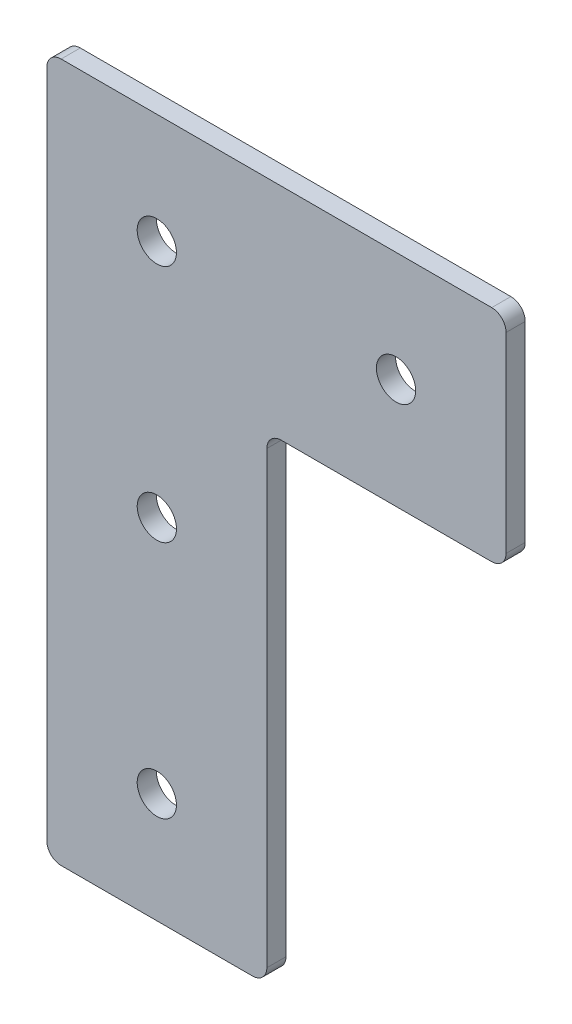
ISO-10303-21;
HEADER;
FILE_DESCRIPTION(('STEP AP214'),'2;1');
FILE_NAME('part.step','',(''),(''),'','','');
FILE_SCHEMA(('AUTOMOTIVE_DESIGN { 1 0 10303 214 1 1 1 1 }'));
ENDSEC;
DATA;
#1=APPLICATION_CONTEXT('core data for automotive mechanical design processes');
#2=APPLICATION_PROTOCOL_DEFINITION('international standard','automotive_design',2000,#1);
#3=PRODUCT_CONTEXT('',#1,'mechanical');
#4=PRODUCT('Part','Part','',(#3));
#5=PRODUCT_RELATED_PRODUCT_CATEGORY('part','',(#4));
#6=PRODUCT_DEFINITION_FORMATION('','',#4);
#7=PRODUCT_DEFINITION_CONTEXT('part definition',#1,'design');
#8=PRODUCT_DEFINITION('design','',#6,#7);
#9=PRODUCT_DEFINITION_SHAPE('','',#8);
#10=(LENGTH_UNIT() NAMED_UNIT(*) SI_UNIT(.MILLI.,.METRE.));
#11=(NAMED_UNIT(*) PLANE_ANGLE_UNIT() SI_UNIT($,.RADIAN.));
#12=(NAMED_UNIT(*) SI_UNIT($,.STERADIAN.) SOLID_ANGLE_UNIT());
#13=UNCERTAINTY_MEASURE_WITH_UNIT(LENGTH_MEASURE(1.E-05),#10,'distance_accuracy_value','');
#14=(GEOMETRIC_REPRESENTATION_CONTEXT(3) GLOBAL_UNCERTAINTY_ASSIGNED_CONTEXT((#13)) GLOBAL_UNIT_ASSIGNED_CONTEXT((#10,
#11,#12)) REPRESENTATION_CONTEXT('',''));
#15=CARTESIAN_POINT('',(0.,0.,0.));
#16=DIRECTION('',(0.,0.,1.));
#17=DIRECTION('',(1.,0.,0.));
#18=AXIS2_PLACEMENT_3D('',#15,#16,#17);
#19=CARTESIAN_POINT('',(0.,0.,4.));
#20=DIRECTION('',(0.,0.,1.));
#21=DIRECTION('',(1.,0.,0.));
#22=AXIS2_PLACEMENT_3D('',#19,#20,#21);
#23=PLANE('',#22);
#24=CARTESIAN_POINT('',(5.20660583828602E-13,-50.,4.));
#25=DIRECTION('',(0.,0.,1.));
#26=DIRECTION('',(1.,0.,0.));
#27=AXIS2_PLACEMENT_3D('',#24,#25,#26);
#28=CIRCLE('',#27,4.1);
#29=CARTESIAN_POINT('',(4.10000000000052,-50.,4.));
#30=VERTEX_POINT('',#29);
#31=EDGE_CURVE('E225',#30,#30,#28,.T.);
#32=ORIENTED_EDGE('',*,*,#31,.F.);
#33=EDGE_LOOP('',(#32));
#34=FACE_BOUND('',#33,.T.);
#35=CARTESIAN_POINT('',(0.,0.,4.));
#36=DIRECTION('',(0.,0.,1.));
#37=DIRECTION('',(1.,0.,0.));
#38=AXIS2_PLACEMENT_3D('',#35,#36,#37);
#39=CIRCLE('',#38,4.1);
#40=CARTESIAN_POINT('',(4.1,0.,4.));
#41=VERTEX_POINT('',#40);
#42=EDGE_CURVE('E133',#41,#41,#39,.T.);
#43=ORIENTED_EDGE('',*,*,#42,.F.);
#44=EDGE_LOOP('',(#43));
#45=FACE_BOUND('',#44,.T.);
#46=DIRECTION('',(-1.,0.,0.));
#47=VECTOR('',#46,1.);
#48=CARTESIAN_POINT('',(-23.,23.,4.));
#49=LINE('',#48,#47);
#50=CARTESIAN_POINT('',(70.,23.,4.));
#51=VERTEX_POINT('',#50);
#52=CARTESIAN_POINT('',(-20.,23.,4.));
#53=VERTEX_POINT('',#52);
#54=EDGE_CURVE('E142',#51,#53,#49,.T.);
#55=ORIENTED_EDGE('',*,*,#54,.T.);
#56=CARTESIAN_POINT('',(-20.,20.,4.));
#57=DIRECTION('',(0.,0.,1.));
#58=DIRECTION('',(1.,0.,0.));
#59=AXIS2_PLACEMENT_3D('',#56,#57,#58);
#60=CIRCLE('',#59,3.);
#61=CARTESIAN_POINT('',(-23.,20.,4.));
#62=VERTEX_POINT('',#61);
#63=EDGE_CURVE('E171',#53,#62,#60,.T.);
#64=ORIENTED_EDGE('',*,*,#63,.T.);
#65=DIRECTION('',(0.,-1.,0.));
#66=VECTOR('',#65,1.);
#67=CARTESIAN_POINT('',(-23.,23.,4.));
#68=LINE('',#67,#66);
#69=CARTESIAN_POINT('',(-23.,-120.,4.));
#70=VERTEX_POINT('',#69);
#71=EDGE_CURVE('E125',#62,#70,#68,.T.);
#72=ORIENTED_EDGE('',*,*,#71,.T.);
#73=CARTESIAN_POINT('',(-20.,-120.,4.));
#74=DIRECTION('',(0.,0.,1.));
#75=DIRECTION('',(1.,0.,0.));
#76=AXIS2_PLACEMENT_3D('',#73,#74,#75);
#77=CIRCLE('',#76,3.);
#78=CARTESIAN_POINT('',(-20.,-123.,4.));
#79=VERTEX_POINT('',#78);
#80=EDGE_CURVE('E169',#70,#79,#77,.T.);
#81=ORIENTED_EDGE('',*,*,#80,.T.);
#82=DIRECTION('',(1.,0.,0.));
#83=VECTOR('',#82,1.);
#84=CARTESIAN_POINT('',(-23.,-123.,4.));
#85=LINE('',#84,#83);
#86=CARTESIAN_POINT('',(20.,-123.,4.));
#87=VERTEX_POINT('',#86);
#88=EDGE_CURVE('E213',#79,#87,#85,.T.);
#89=ORIENTED_EDGE('',*,*,#88,.T.);
#90=CARTESIAN_POINT('',(20.,-120.,4.));
#91=DIRECTION('',(0.,0.,1.));
#92=DIRECTION('',(1.,0.,0.));
#93=AXIS2_PLACEMENT_3D('',#90,#91,#92);
#94=CIRCLE('',#93,3.);
#95=CARTESIAN_POINT('',(23.,-120.,4.));
#96=VERTEX_POINT('',#95);
#97=EDGE_CURVE('E167',#87,#96,#94,.T.);
#98=ORIENTED_EDGE('',*,*,#97,.T.);
#99=DIRECTION('',(0.,1.,0.));
#100=VECTOR('',#99,1.);
#101=CARTESIAN_POINT('',(23.,-23.,4.));
#102=LINE('',#101,#100);
#103=CARTESIAN_POINT('',(23.,-26.,4.));
#104=VERTEX_POINT('',#103);
#105=EDGE_CURVE('E207',#96,#104,#102,.T.);
#106=ORIENTED_EDGE('',*,*,#105,.T.);
#107=CARTESIAN_POINT('',(26.,-26.,4.));
#108=DIRECTION('',(0.,0.,1.));
#109=DIRECTION('',(1.,0.,0.));
#110=AXIS2_PLACEMENT_3D('',#107,#108,#109);
#111=CIRCLE('',#110,3.);
#112=CARTESIAN_POINT('',(26.,-23.,4.));
#113=VERTEX_POINT('',#112);
#114=EDGE_CURVE('E9',#104,#113,#111,.F.);
#115=ORIENTED_EDGE('',*,*,#114,.T.);
#116=DIRECTION('',(1.,0.,0.));
#117=VECTOR('',#116,1.);
#118=CARTESIAN_POINT('',(23.,-23.,4.));
#119=LINE('',#118,#117);
#120=CARTESIAN_POINT('',(70.,-23.,4.));
#121=VERTEX_POINT('',#120);
#122=EDGE_CURVE('E206',#113,#121,#119,.T.);
#123=ORIENTED_EDGE('',*,*,#122,.T.);
#124=CARTESIAN_POINT('',(70.,-20.,4.));
#125=DIRECTION('',(0.,0.,1.));
#126=DIRECTION('',(1.,0.,0.));
#127=AXIS2_PLACEMENT_3D('',#124,#125,#126);
#128=CIRCLE('',#127,3.);
#129=CARTESIAN_POINT('',(73.,-20.,4.));
#130=VERTEX_POINT('',#129);
#131=EDGE_CURVE('E37',#121,#130,#128,.T.);
#132=ORIENTED_EDGE('',*,*,#131,.T.);
#133=DIRECTION('',(0.,1.,0.));
#134=VECTOR('',#133,1.);
#135=CARTESIAN_POINT('',(73.,23.,4.));
#136=LINE('',#135,#134);
#137=CARTESIAN_POINT('',(73.,20.,4.));
#138=VERTEX_POINT('',#137);
#139=EDGE_CURVE('E211',#130,#138,#136,.T.);
#140=ORIENTED_EDGE('',*,*,#139,.T.);
#141=CARTESIAN_POINT('',(70.,20.,4.));
#142=DIRECTION('',(0.,0.,1.));
#143=DIRECTION('',(1.,0.,0.));
#144=AXIS2_PLACEMENT_3D('',#141,#142,#143);
#145=CIRCLE('',#144,3.);
#146=EDGE_CURVE('E165',#138,#51,#145,.T.);
#147=ORIENTED_EDGE('',*,*,#146,.T.);
#148=EDGE_LOOP('',(#55,#64,#72,#81,#89,#98,#106,#115,#123,#132,#140,#147));
#149=FACE_BOUND('',#148,.T.);
#150=CARTESIAN_POINT('',(50.,0.,4.));
#151=DIRECTION('',(0.,0.,1.));
#152=DIRECTION('',(1.,0.,0.));
#153=AXIS2_PLACEMENT_3D('',#150,#151,#152);
#154=CIRCLE('',#153,4.09999999999999);
#155=CARTESIAN_POINT('',(54.1,0.,4.));
#156=VERTEX_POINT('',#155);
#157=EDGE_CURVE('E220',#156,#156,#154,.T.);
#158=ORIENTED_EDGE('',*,*,#157,.F.);
#159=EDGE_LOOP('',(#158));
#160=FACE_BOUND('',#159,.T.);
#161=CARTESIAN_POINT('',(1.0413211676572E-12,-100.,4.));
#162=DIRECTION('',(0.,0.,1.));
#163=DIRECTION('',(1.,0.,0.));
#164=AXIS2_PLACEMENT_3D('',#161,#162,#163);
#165=CIRCLE('',#164,4.1);
#166=CARTESIAN_POINT('',(4.10000000000105,-100.,4.));
#167=VERTEX_POINT('',#166);
#168=EDGE_CURVE('E231',#167,#167,#165,.T.);
#169=ORIENTED_EDGE('',*,*,#168,.F.);
#170=EDGE_LOOP('',(#169));
#171=FACE_BOUND('',#170,.T.);
#172=ADVANCED_FACE('F15',(#34,#45,#149,#160,#171),#23,.T.);
#173=CARTESIAN_POINT('',(0.,0.,0.));
#174=DIRECTION('',(0.,0.,1.));
#175=DIRECTION('',(1.,0.,0.));
#176=AXIS2_PLACEMENT_3D('',#173,#174,#175);
#177=PLANE('',#176);
#178=DIRECTION('',(0.,-1.,0.));
#179=VECTOR('',#178,1.);
#180=CARTESIAN_POINT('',(-23.,-23.,0.));
#181=LINE('',#180,#179);
#182=CARTESIAN_POINT('',(-23.,20.,0.));
#183=VERTEX_POINT('',#182);
#184=CARTESIAN_POINT('',(-23.,-120.,0.));
#185=VERTEX_POINT('',#184);
#186=EDGE_CURVE('E122',#183,#185,#181,.T.);
#187=ORIENTED_EDGE('',*,*,#186,.F.);
#188=CARTESIAN_POINT('',(-20.,20.,0.));
#189=DIRECTION('',(0.,0.,1.));
#190=DIRECTION('',(1.,0.,0.));
#191=AXIS2_PLACEMENT_3D('',#188,#189,#190);
#192=CIRCLE('',#191,3.);
#193=CARTESIAN_POINT('',(-20.,23.,0.));
#194=VERTEX_POINT('',#193);
#195=EDGE_CURVE('E105',#183,#194,#192,.F.);
#196=ORIENTED_EDGE('',*,*,#195,.T.);
#197=DIRECTION('',(-1.,0.,0.));
#198=VECTOR('',#197,1.);
#199=CARTESIAN_POINT('',(-23.,23.,0.));
#200=LINE('',#199,#198);
#201=CARTESIAN_POINT('',(70.,23.,0.));
#202=VERTEX_POINT('',#201);
#203=EDGE_CURVE('E152',#202,#194,#200,.T.);
#204=ORIENTED_EDGE('',*,*,#203,.F.);
#205=CARTESIAN_POINT('',(70.,20.,0.));
#206=DIRECTION('',(0.,0.,1.));
#207=DIRECTION('',(1.,0.,0.));
#208=AXIS2_PLACEMENT_3D('',#205,#206,#207);
#209=CIRCLE('',#208,3.);
#210=CARTESIAN_POINT('',(73.,20.,0.));
#211=VERTEX_POINT('',#210);
#212=EDGE_CURVE('E156',#202,#211,#209,.F.);
#213=ORIENTED_EDGE('',*,*,#212,.T.);
#214=DIRECTION('',(0.,1.,0.));
#215=VECTOR('',#214,1.);
#216=CARTESIAN_POINT('',(73.,23.,0.));
#217=LINE('',#216,#215);
#218=CARTESIAN_POINT('',(73.,-20.,0.));
#219=VERTEX_POINT('',#218);
#220=EDGE_CURVE('E150',#219,#211,#217,.T.);
#221=ORIENTED_EDGE('',*,*,#220,.F.);
#222=CARTESIAN_POINT('',(70.,-20.,0.));
#223=DIRECTION('',(0.,0.,1.));
#224=DIRECTION('',(1.,0.,0.));
#225=AXIS2_PLACEMENT_3D('',#222,#223,#224);
#226=CIRCLE('',#225,3.);
#227=CARTESIAN_POINT('',(70.,-23.,0.));
#228=VERTEX_POINT('',#227);
#229=EDGE_CURVE('E126',#219,#228,#226,.F.);
#230=ORIENTED_EDGE('',*,*,#229,.T.);
#231=DIRECTION('',(1.,0.,0.));
#232=VECTOR('',#231,1.);
#233=CARTESIAN_POINT('',(23.,-23.,0.));
#234=LINE('',#233,#232);
#235=CARTESIAN_POINT('',(26.,-23.,0.));
#236=VERTEX_POINT('',#235);
#237=EDGE_CURVE('E147',#236,#228,#234,.T.);
#238=ORIENTED_EDGE('',*,*,#237,.F.);
#239=CARTESIAN_POINT('',(26.,-26.,0.));
#240=DIRECTION('',(0.,0.,1.));
#241=DIRECTION('',(1.,0.,0.));
#242=AXIS2_PLACEMENT_3D('',#239,#240,#241);
#243=CIRCLE('',#242,3.);
#244=CARTESIAN_POINT('',(23.,-26.,0.));
#245=VERTEX_POINT('',#244);
#246=EDGE_CURVE('E23',#236,#245,#243,.T.);
#247=ORIENTED_EDGE('',*,*,#246,.T.);
#248=DIRECTION('',(0.,1.,0.));
#249=VECTOR('',#248,1.);
#250=CARTESIAN_POINT('',(23.,-23.,0.));
#251=LINE('',#250,#249);
#252=CARTESIAN_POINT('',(23.,-120.,0.));
#253=VERTEX_POINT('',#252);
#254=EDGE_CURVE('E136',#253,#245,#251,.T.);
#255=ORIENTED_EDGE('',*,*,#254,.F.);
#256=CARTESIAN_POINT('',(20.,-120.,0.));
#257=DIRECTION('',(0.,0.,1.));
#258=DIRECTION('',(1.,0.,0.));
#259=AXIS2_PLACEMENT_3D('',#256,#257,#258);
#260=CIRCLE('',#259,3.);
#261=CARTESIAN_POINT('',(20.,-123.,0.));
#262=VERTEX_POINT('',#261);
#263=EDGE_CURVE('E158',#253,#262,#260,.F.);
#264=ORIENTED_EDGE('',*,*,#263,.T.);
#265=DIRECTION('',(1.,0.,0.));
#266=VECTOR('',#265,1.);
#267=CARTESIAN_POINT('',(-23.,-123.,0.));
#268=LINE('',#267,#266);
#269=CARTESIAN_POINT('',(-20.,-123.,0.));
#270=VERTEX_POINT('',#269);
#271=EDGE_CURVE('E132',#270,#262,#268,.T.);
#272=ORIENTED_EDGE('',*,*,#271,.F.);
#273=CARTESIAN_POINT('',(-20.,-120.,0.));
#274=DIRECTION('',(0.,0.,1.));
#275=DIRECTION('',(1.,0.,0.));
#276=AXIS2_PLACEMENT_3D('',#273,#274,#275);
#277=CIRCLE('',#276,3.);
#278=EDGE_CURVE('E116',#270,#185,#277,.F.);
#279=ORIENTED_EDGE('',*,*,#278,.T.);
#280=EDGE_LOOP('',(#187,#196,#204,#213,#221,#230,#238,#247,#255,#264,#272,#279));
#281=FACE_BOUND('',#280,.T.);
#282=CARTESIAN_POINT('',(0.,0.,0.));
#283=DIRECTION('',(0.,0.,1.));
#284=DIRECTION('',(1.,0.,0.));
#285=AXIS2_PLACEMENT_3D('',#282,#283,#284);
#286=CIRCLE('',#285,4.1);
#287=CARTESIAN_POINT('',(4.1,0.,0.));
#288=VERTEX_POINT('',#287);
#289=EDGE_CURVE('E139',#288,#288,#286,.T.);
#290=ORIENTED_EDGE('',*,*,#289,.T.);
#291=EDGE_LOOP('',(#290));
#292=FACE_BOUND('',#291,.T.);
#293=CARTESIAN_POINT('',(50.,0.,0.));
#294=DIRECTION('',(0.,0.,1.));
#295=DIRECTION('',(1.,0.,0.));
#296=AXIS2_PLACEMENT_3D('',#293,#294,#295);
#297=CIRCLE('',#296,4.09999999999999);
#298=CARTESIAN_POINT('',(54.1,0.,0.));
#299=VERTEX_POINT('',#298);
#300=EDGE_CURVE('E222',#299,#299,#297,.T.);
#301=ORIENTED_EDGE('',*,*,#300,.T.);
#302=EDGE_LOOP('',(#301));
#303=FACE_BOUND('',#302,.T.);
#304=CARTESIAN_POINT('',(5.20660583828602E-13,-50.,0.));
#305=DIRECTION('',(0.,0.,1.));
#306=DIRECTION('',(1.,0.,0.));
#307=AXIS2_PLACEMENT_3D('',#304,#305,#306);
#308=CIRCLE('',#307,4.1);
#309=CARTESIAN_POINT('',(4.10000000000052,-50.,0.));
#310=VERTEX_POINT('',#309);
#311=EDGE_CURVE('E228',#310,#310,#308,.T.);
#312=ORIENTED_EDGE('',*,*,#311,.T.);
#313=EDGE_LOOP('',(#312));
#314=FACE_BOUND('',#313,.T.);
#315=CARTESIAN_POINT('',(1.0413211676572E-12,-100.,0.));
#316=DIRECTION('',(0.,0.,1.));
#317=DIRECTION('',(1.,0.,0.));
#318=AXIS2_PLACEMENT_3D('',#315,#316,#317);
#319=CIRCLE('',#318,4.1);
#320=CARTESIAN_POINT('',(4.10000000000105,-100.,0.));
#321=VERTEX_POINT('',#320);
#322=EDGE_CURVE('E234',#321,#321,#319,.T.);
#323=ORIENTED_EDGE('',*,*,#322,.T.);
#324=EDGE_LOOP('',(#323));
#325=FACE_BOUND('',#324,.T.);
#326=ADVANCED_FACE('F129',(#281,#292,#303,#314,#325),#177,.F.);
#327=CARTESIAN_POINT('',(-23.,-23.,4.));
#328=DIRECTION('',(1.,0.,0.));
#329=DIRECTION('',(0.,1.,0.));
#330=AXIS2_PLACEMENT_3D('',#327,#328,#329);
#331=PLANE('',#330);
#332=ORIENTED_EDGE('',*,*,#71,.F.);
#333=DIRECTION('',(0.,0.,-1.));
#334=VECTOR('',#333,1.);
#335=CARTESIAN_POINT('',(-23.,20.,4.));
#336=LINE('',#335,#334);
#337=EDGE_CURVE('E109',#62,#183,#336,.T.);
#338=ORIENTED_EDGE('',*,*,#337,.T.);
#339=ORIENTED_EDGE('',*,*,#186,.T.);
#340=DIRECTION('',(0.,0.,-1.));
#341=VECTOR('',#340,1.);
#342=CARTESIAN_POINT('',(-23.,-120.,4.));
#343=LINE('',#342,#341);
#344=EDGE_CURVE('E127',#185,#70,#343,.F.);
#345=ORIENTED_EDGE('',*,*,#344,.T.);
#346=EDGE_LOOP('',(#332,#338,#339,#345));
#347=FACE_BOUND('',#346,.T.);
#348=ADVANCED_FACE('F121',(#347),#331,.F.);
#349=CARTESIAN_POINT('',(-23.,-123.,4.));
#350=DIRECTION('',(0.,1.,0.));
#351=DIRECTION('',(0.,0.,1.));
#352=AXIS2_PLACEMENT_3D('',#349,#350,#351);
#353=PLANE('',#352);
#354=ORIENTED_EDGE('',*,*,#88,.F.);
#355=DIRECTION('',(0.,0.,-1.));
#356=VECTOR('',#355,1.);
#357=CARTESIAN_POINT('',(-20.,-123.,4.));
#358=LINE('',#357,#356);
#359=EDGE_CURVE('E175',#79,#270,#358,.T.);
#360=ORIENTED_EDGE('',*,*,#359,.T.);
#361=ORIENTED_EDGE('',*,*,#271,.T.);
#362=DIRECTION('',(0.,0.,-1.));
#363=VECTOR('',#362,1.);
#364=CARTESIAN_POINT('',(20.,-123.,4.));
#365=LINE('',#364,#363);
#366=EDGE_CURVE('E173',#262,#87,#365,.F.);
#367=ORIENTED_EDGE('',*,*,#366,.T.);
#368=EDGE_LOOP('',(#354,#360,#361,#367));
#369=FACE_BOUND('',#368,.T.);
#370=ADVANCED_FACE('F268',(#369),#353,.F.);
#371=CARTESIAN_POINT('',(23.,-23.,4.));
#372=DIRECTION('',(-1.,0.,0.));
#373=DIRECTION('',(0.,-1.,0.));
#374=AXIS2_PLACEMENT_3D('',#371,#372,#373);
#375=PLANE('',#374);
#376=ORIENTED_EDGE('',*,*,#105,.F.);
#377=DIRECTION('',(0.,0.,-1.));
#378=VECTOR('',#377,1.);
#379=CARTESIAN_POINT('',(23.,-120.,4.));
#380=LINE('',#379,#378);
#381=EDGE_CURVE('E180',#96,#253,#380,.T.);
#382=ORIENTED_EDGE('',*,*,#381,.T.);
#383=ORIENTED_EDGE('',*,*,#254,.T.);
#384=DIRECTION('',(0.,0.,-1.));
#385=VECTOR('',#384,1.);
#386=CARTESIAN_POINT('',(23.,-26.,4.));
#387=LINE('',#386,#385);
#388=EDGE_CURVE('E178',#245,#104,#387,.F.);
#389=ORIENTED_EDGE('',*,*,#388,.T.);
#390=EDGE_LOOP('',(#376,#382,#383,#389));
#391=FACE_BOUND('',#390,.T.);
#392=ADVANCED_FACE('F198',(#391),#375,.F.);
#393=CARTESIAN_POINT('',(23.,-23.,4.));
#394=DIRECTION('',(0.,1.,0.));
#395=DIRECTION('',(-1.,0.,0.));
#396=AXIS2_PLACEMENT_3D('',#393,#394,#395);
#397=PLANE('',#396);
#398=ORIENTED_EDGE('',*,*,#122,.F.);
#399=DIRECTION('',(0.,0.,-1.));
#400=VECTOR('',#399,1.);
#401=CARTESIAN_POINT('',(26.,-23.,0.));
#402=LINE('',#401,#400);
#403=EDGE_CURVE('E185',#113,#236,#402,.T.);
#404=ORIENTED_EDGE('',*,*,#403,.T.);
#405=ORIENTED_EDGE('',*,*,#237,.T.);
#406=DIRECTION('',(0.,0.,-1.));
#407=VECTOR('',#406,1.);
#408=CARTESIAN_POINT('',(70.,-23.,4.));
#409=LINE('',#408,#407);
#410=EDGE_CURVE('E183',#228,#121,#409,.F.);
#411=ORIENTED_EDGE('',*,*,#410,.T.);
#412=EDGE_LOOP('',(#398,#404,#405,#411));
#413=FACE_BOUND('',#412,.T.);
#414=ADVANCED_FACE('F209',(#413),#397,.F.);
#415=CARTESIAN_POINT('',(73.,23.,4.));
#416=DIRECTION('',(-1.,0.,0.));
#417=DIRECTION('',(0.,0.,1.));
#418=AXIS2_PLACEMENT_3D('',#415,#416,#417);
#419=PLANE('',#418);
#420=ORIENTED_EDGE('',*,*,#220,.T.);
#421=DIRECTION('',(0.,0.,-1.));
#422=VECTOR('',#421,1.);
#423=CARTESIAN_POINT('',(73.,20.,4.));
#424=LINE('',#423,#422);
#425=EDGE_CURVE('E30',#211,#138,#424,.F.);
#426=ORIENTED_EDGE('',*,*,#425,.T.);
#427=ORIENTED_EDGE('',*,*,#139,.F.);
#428=DIRECTION('',(0.,0.,-1.));
#429=VECTOR('',#428,1.);
#430=CARTESIAN_POINT('',(73.,-20.,4.));
#431=LINE('',#430,#429);
#432=EDGE_CURVE('E188',#130,#219,#431,.T.);
#433=ORIENTED_EDGE('',*,*,#432,.T.);
#434=EDGE_LOOP('',(#420,#426,#427,#433));
#435=FACE_BOUND('',#434,.T.);
#436=ADVANCED_FACE('F260',(#435),#419,.F.);
#437=CARTESIAN_POINT('',(-23.,23.,4.));
#438=DIRECTION('',(0.,-1.,0.));
#439=DIRECTION('',(1.,0.,0.));
#440=AXIS2_PLACEMENT_3D('',#437,#438,#439);
#441=PLANE('',#440);
#442=ORIENTED_EDGE('',*,*,#203,.T.);
#443=DIRECTION('',(0.,0.,-1.));
#444=VECTOR('',#443,1.);
#445=CARTESIAN_POINT('',(-20.,23.,4.));
#446=LINE('',#445,#444);
#447=EDGE_CURVE('E110',#194,#53,#446,.F.);
#448=ORIENTED_EDGE('',*,*,#447,.T.);
#449=ORIENTED_EDGE('',*,*,#54,.F.);
#450=DIRECTION('',(0.,0.,-1.));
#451=VECTOR('',#450,1.);
#452=CARTESIAN_POINT('',(70.,23.,4.));
#453=LINE('',#452,#451);
#454=EDGE_CURVE('E115',#51,#202,#453,.T.);
#455=ORIENTED_EDGE('',*,*,#454,.T.);
#456=EDGE_LOOP('',(#442,#448,#449,#455));
#457=FACE_BOUND('',#456,.T.);
#458=ADVANCED_FACE('F257',(#457),#441,.F.);
#459=CARTESIAN_POINT('',(0.,0.,4.));
#460=DIRECTION('',(0.,0.,-1.));
#461=DIRECTION('',(-1.,0.,0.));
#462=AXIS2_PLACEMENT_3D('',#459,#460,#461);
#463=CYLINDRICAL_SURFACE('',#462,4.1);
#464=ORIENTED_EDGE('',*,*,#42,.T.);
#465=EDGE_LOOP('',(#464));
#466=FACE_BOUND('',#465,.T.);
#467=ORIENTED_EDGE('',*,*,#289,.F.);
#468=EDGE_LOOP('',(#467));
#469=FACE_BOUND('',#468,.T.);
#470=ADVANCED_FACE('F254',(#466,#469),#463,.F.);
#471=CARTESIAN_POINT('',(50.,0.,4.));
#472=DIRECTION('',(0.,0.,-1.));
#473=DIRECTION('',(-1.,0.,0.));
#474=AXIS2_PLACEMENT_3D('',#471,#472,#473);
#475=CYLINDRICAL_SURFACE('',#474,4.09999999999999);
#476=ORIENTED_EDGE('',*,*,#157,.T.);
#477=EDGE_LOOP('',(#476));
#478=FACE_BOUND('',#477,.T.);
#479=ORIENTED_EDGE('',*,*,#300,.F.);
#480=EDGE_LOOP('',(#479));
#481=FACE_BOUND('',#480,.T.);
#482=ADVANCED_FACE('F357',(#478,#481),#475,.F.);
#483=CARTESIAN_POINT('',(5.20660583828602E-13,-50.,4.));
#484=DIRECTION('',(0.,0.,-1.));
#485=DIRECTION('',(-1.,0.,0.));
#486=AXIS2_PLACEMENT_3D('',#483,#484,#485);
#487=CYLINDRICAL_SURFACE('',#486,4.1);
#488=ORIENTED_EDGE('',*,*,#31,.T.);
#489=EDGE_LOOP('',(#488));
#490=FACE_BOUND('',#489,.T.);
#491=ORIENTED_EDGE('',*,*,#311,.F.);
#492=EDGE_LOOP('',(#491));
#493=FACE_BOUND('',#492,.T.);
#494=ADVANCED_FACE('F348',(#490,#493),#487,.F.);
#495=CARTESIAN_POINT('',(1.0413211676572E-12,-100.,4.));
#496=DIRECTION('',(0.,0.,-1.));
#497=DIRECTION('',(-1.,0.,0.));
#498=AXIS2_PLACEMENT_3D('',#495,#496,#497);
#499=CYLINDRICAL_SURFACE('',#498,4.1);
#500=ORIENTED_EDGE('',*,*,#168,.T.);
#501=EDGE_LOOP('',(#500));
#502=FACE_BOUND('',#501,.T.);
#503=ORIENTED_EDGE('',*,*,#322,.F.);
#504=EDGE_LOOP('',(#503));
#505=FACE_BOUND('',#504,.T.);
#506=ADVANCED_FACE('F240',(#502,#505),#499,.F.);
#507=CARTESIAN_POINT('',(-20.,20.,4.));
#508=DIRECTION('',(0.,0.,-1.));
#509=DIRECTION('',(-1.,0.,0.));
#510=AXIS2_PLACEMENT_3D('',#507,#508,#509);
#511=CYLINDRICAL_SURFACE('',#510,3.);
#512=ORIENTED_EDGE('',*,*,#63,.F.);
#513=ORIENTED_EDGE('',*,*,#447,.F.);
#514=ORIENTED_EDGE('',*,*,#195,.F.);
#515=ORIENTED_EDGE('',*,*,#337,.F.);
#516=EDGE_LOOP('',(#512,#513,#514,#515));
#517=FACE_BOUND('',#516,.T.);
#518=ADVANCED_FACE('F108',(#517),#511,.T.);
#519=CARTESIAN_POINT('',(-20.,-120.,4.));
#520=DIRECTION('',(0.,0.,-1.));
#521=DIRECTION('',(-1.,0.,0.));
#522=AXIS2_PLACEMENT_3D('',#519,#520,#521);
#523=CYLINDRICAL_SURFACE('',#522,3.);
#524=ORIENTED_EDGE('',*,*,#80,.F.);
#525=ORIENTED_EDGE('',*,*,#344,.F.);
#526=ORIENTED_EDGE('',*,*,#278,.F.);
#527=ORIENTED_EDGE('',*,*,#359,.F.);
#528=EDGE_LOOP('',(#524,#525,#526,#527));
#529=FACE_BOUND('',#528,.T.);
#530=ADVANCED_FACE('F276',(#529),#523,.T.);
#531=CARTESIAN_POINT('',(20.,-120.,4.));
#532=DIRECTION('',(0.,0.,-1.));
#533=DIRECTION('',(-1.,0.,0.));
#534=AXIS2_PLACEMENT_3D('',#531,#532,#533);
#535=CYLINDRICAL_SURFACE('',#534,3.);
#536=ORIENTED_EDGE('',*,*,#97,.F.);
#537=ORIENTED_EDGE('',*,*,#366,.F.);
#538=ORIENTED_EDGE('',*,*,#263,.F.);
#539=ORIENTED_EDGE('',*,*,#381,.F.);
#540=EDGE_LOOP('',(#536,#537,#538,#539));
#541=FACE_BOUND('',#540,.T.);
#542=ADVANCED_FACE('F279',(#541),#535,.T.);
#543=CARTESIAN_POINT('',(26.,-26.,4.));
#544=DIRECTION('',(0.,0.,1.));
#545=DIRECTION('',(1.,0.,0.));
#546=AXIS2_PLACEMENT_3D('',#543,#544,#545);
#547=CYLINDRICAL_SURFACE('',#546,3.);
#548=ORIENTED_EDGE('',*,*,#114,.F.);
#549=ORIENTED_EDGE('',*,*,#388,.F.);
#550=ORIENTED_EDGE('',*,*,#246,.F.);
#551=ORIENTED_EDGE('',*,*,#403,.F.);
#552=EDGE_LOOP('',(#548,#549,#550,#551));
#553=FACE_BOUND('',#552,.T.);
#554=ADVANCED_FACE('F202',(#553),#547,.F.);
#555=CARTESIAN_POINT('',(70.,20.,4.));
#556=DIRECTION('',(0.,0.,-1.));
#557=DIRECTION('',(-1.,0.,0.));
#558=AXIS2_PLACEMENT_3D('',#555,#556,#557);
#559=CYLINDRICAL_SURFACE('',#558,3.);
#560=ORIENTED_EDGE('',*,*,#146,.F.);
#561=ORIENTED_EDGE('',*,*,#425,.F.);
#562=ORIENTED_EDGE('',*,*,#212,.F.);
#563=ORIENTED_EDGE('',*,*,#454,.F.);
#564=EDGE_LOOP('',(#560,#561,#562,#563));
#565=FACE_BOUND('',#564,.T.);
#566=ADVANCED_FACE('F285',(#565),#559,.T.);
#567=CARTESIAN_POINT('',(70.,-20.,4.));
#568=DIRECTION('',(0.,0.,-1.));
#569=DIRECTION('',(-1.,0.,0.));
#570=AXIS2_PLACEMENT_3D('',#567,#568,#569);
#571=CYLINDRICAL_SURFACE('',#570,3.);
#572=ORIENTED_EDGE('',*,*,#131,.F.);
#573=ORIENTED_EDGE('',*,*,#410,.F.);
#574=ORIENTED_EDGE('',*,*,#229,.F.);
#575=ORIENTED_EDGE('',*,*,#432,.F.);
#576=EDGE_LOOP('',(#572,#573,#574,#575));
#577=FACE_BOUND('',#576,.T.);
#578=ADVANCED_FACE('F17',(#577),#571,.T.);
#579=CLOSED_SHELL('',(#172,#326,#348,#370,#392,#414,#436,#458,#470,#482,#494,#506,#518,#530,
#542,#554,#566,#578));
#580=MANIFOLD_SOLID_BREP('B1',#579);
#581=ADVANCED_BREP_SHAPE_REPRESENTATION('',(#18,#580),#14);
#582=SHAPE_DEFINITION_REPRESENTATION(#9,#581);
ENDSEC;
END-ISO-10303-21;
